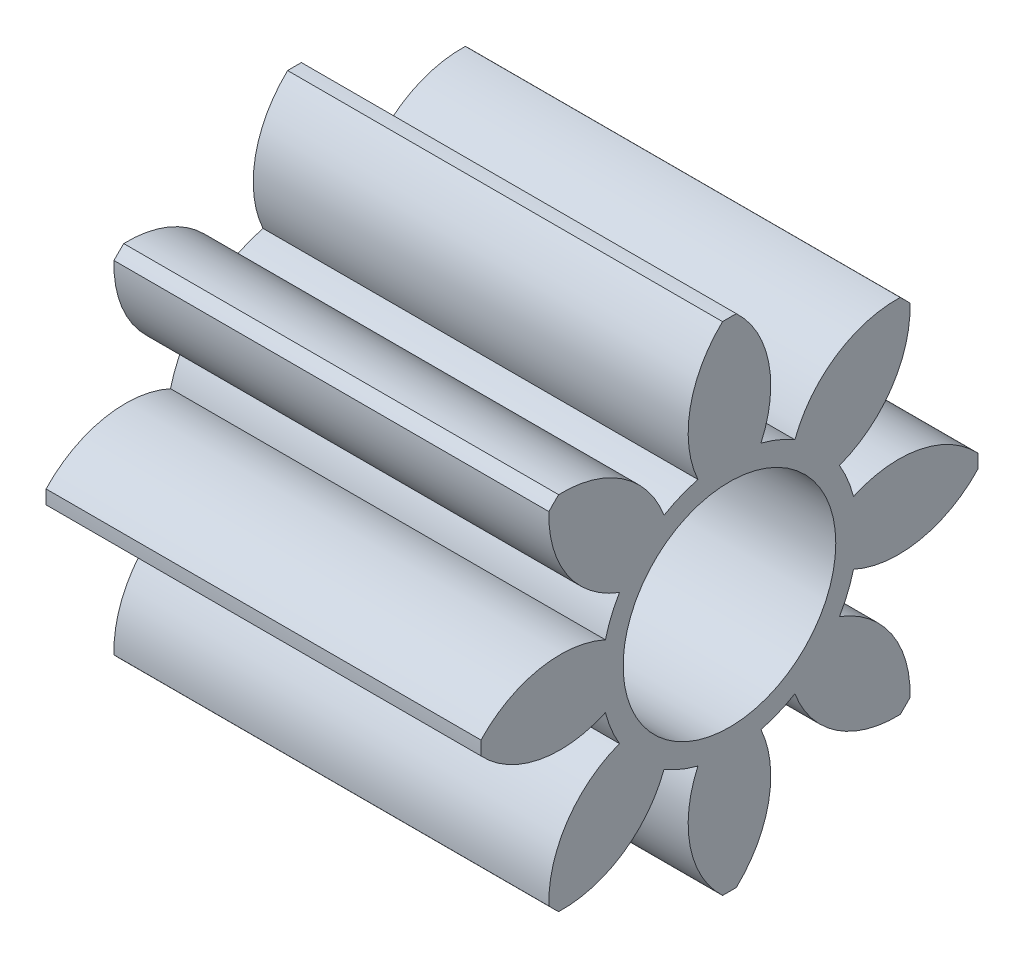
ISO-10303-21;
HEADER;
FILE_DESCRIPTION(('STEP AP214'),'2;1');
FILE_NAME('part.step','',(''),(''),'','','');
FILE_SCHEMA(('AUTOMOTIVE_DESIGN { 1 0 10303 214 1 1 1 1 }'));
ENDSEC;
DATA;
#1=APPLICATION_CONTEXT('core data for automotive mechanical design processes');
#2=APPLICATION_PROTOCOL_DEFINITION('international standard','automotive_design',2000,#1);
#3=PRODUCT_CONTEXT('',#1,'mechanical');
#4=PRODUCT('Part','Part','',(#3));
#5=PRODUCT_RELATED_PRODUCT_CATEGORY('part','',(#4));
#6=PRODUCT_DEFINITION_FORMATION('','',#4);
#7=PRODUCT_DEFINITION_CONTEXT('part definition',#1,'design');
#8=PRODUCT_DEFINITION('design','',#6,#7);
#9=PRODUCT_DEFINITION_SHAPE('','',#8);
#10=(LENGTH_UNIT() NAMED_UNIT(*) SI_UNIT(.MILLI.,.METRE.));
#11=(NAMED_UNIT(*) PLANE_ANGLE_UNIT() SI_UNIT($,.RADIAN.));
#12=(NAMED_UNIT(*) SI_UNIT($,.STERADIAN.) SOLID_ANGLE_UNIT());
#13=UNCERTAINTY_MEASURE_WITH_UNIT(LENGTH_MEASURE(1.E-05),#10,'distance_accuracy_value','');
#14=(GEOMETRIC_REPRESENTATION_CONTEXT(3) GLOBAL_UNCERTAINTY_ASSIGNED_CONTEXT((#13)) GLOBAL_UNIT_ASSIGNED_CONTEXT((#10,
#11,#12)) REPRESENTATION_CONTEXT('',''));
#15=CARTESIAN_POINT('',(0.,0.,0.));
#16=DIRECTION('',(0.,0.,1.));
#17=DIRECTION('',(1.,0.,0.));
#18=AXIS2_PLACEMENT_3D('',#15,#16,#17);
#19=CARTESIAN_POINT('',(4.,0.,0.));
#20=DIRECTION('',(-1.,0.,0.));
#21=DIRECTION('',(0.,0.,1.));
#22=AXIS2_PLACEMENT_3D('',#19,#20,#21);
#23=CYLINDRICAL_SURFACE('',#22,2.286);
#24=CARTESIAN_POINT('',(4.,0.,0.));
#25=DIRECTION('',(1.,0.,0.));
#26=DIRECTION('',(0.,0.,-1.));
#27=AXIS2_PLACEMENT_3D('',#24,#25,#26);
#28=CIRCLE('',#27,2.286);
#29=CARTESIAN_POINT('',(4.,1.66072536231653,1.57091924393287));
#30=VERTEX_POINT('',#29);
#31=CARTESIAN_POINT('',(4.,1.57091924393288,1.66072536231652));
#32=VERTEX_POINT('',#31);
#33=EDGE_CURVE('E437',#30,#32,#28,.T.);
#34=ORIENTED_EDGE('',*,*,#33,.F.);
#35=DIRECTION('',(1.,0.,0.));
#36=VECTOR('',#35,1.);
#37=CARTESIAN_POINT('',(2.,1.66072536231653,1.57091924393287));
#38=LINE('',#37,#36);
#39=CARTESIAN_POINT('',(0.,1.66072536231653,1.57091924393287));
#40=VERTEX_POINT('',#39);
#41=EDGE_CURVE('E11',#30,#40,#38,.F.);
#42=ORIENTED_EDGE('',*,*,#41,.T.);
#43=CARTESIAN_POINT('',(0.,0.,0.));
#44=DIRECTION('',(1.,0.,0.));
#45=DIRECTION('',(0.,0.,-1.));
#46=AXIS2_PLACEMENT_3D('',#43,#44,#45);
#47=CIRCLE('',#46,2.286);
#48=CARTESIAN_POINT('',(0.,1.57091924393288,1.66072536231652));
#49=VERTEX_POINT('',#48);
#50=EDGE_CURVE('E429',#40,#49,#47,.T.);
#51=ORIENTED_EDGE('',*,*,#50,.T.);
#52=DIRECTION('',(1.,0.,0.));
#53=VECTOR('',#52,1.);
#54=CARTESIAN_POINT('',(2.,1.57091924393288,1.66072536231652));
#55=LINE('',#54,#53);
#56=EDGE_CURVE('E435',#49,#32,#55,.T.);
#57=ORIENTED_EDGE('',*,*,#56,.T.);
#58=EDGE_LOOP('',(#34,#42,#51,#57));
#59=FACE_BOUND('',#58,.T.);
#60=ADVANCED_FACE('F34',(#59),#23,.T.);
#61=CARTESIAN_POINT('',(0.,2.28511781546388,-0.0635025153011266));
#62=VERTEX_POINT('',#61);
#63=CARTESIAN_POINT('',(0.,2.28511781546388,0.0635025153011124));
#64=VERTEX_POINT('',#63);
#65=EDGE_CURVE('E485',#62,#64,#47,.T.);
#66=ORIENTED_EDGE('',*,*,#65,.T.);
#67=DIRECTION('',(1.,0.,0.));
#68=VECTOR('',#67,1.);
#69=CARTESIAN_POINT('',(2.,2.28511781546388,0.0635025153011125));
#70=LINE('',#69,#68);
#71=CARTESIAN_POINT('',(4.,2.28511781546388,0.0635025153011124));
#72=VERTEX_POINT('',#71);
#73=EDGE_CURVE('E42',#64,#72,#70,.T.);
#74=ORIENTED_EDGE('',*,*,#73,.T.);
#75=CARTESIAN_POINT('',(4.,2.28511781546388,-0.0635025153011266));
#76=VERTEX_POINT('',#75);
#77=EDGE_CURVE('E483',#76,#72,#28,.T.);
#78=ORIENTED_EDGE('',*,*,#77,.F.);
#79=DIRECTION('',(1.,0.,0.));
#80=VECTOR('',#79,1.);
#81=CARTESIAN_POINT('',(2.,2.28511781546388,-0.0635025153011266));
#82=LINE('',#81,#80);
#83=EDGE_CURVE('E476',#76,#62,#82,.F.);
#84=ORIENTED_EDGE('',*,*,#83,.T.);
#85=EDGE_LOOP('',(#66,#74,#78,#84));
#86=FACE_BOUND('',#85,.T.);
#87=ADVANCED_FACE('F482',(#86),#23,.T.);
#88=CARTESIAN_POINT('',(0.,1.57091924393287,-1.66072536231653));
#89=VERTEX_POINT('',#88);
#90=CARTESIAN_POINT('',(0.,1.66072536231652,-1.57091924393288));
#91=VERTEX_POINT('',#90);
#92=EDGE_CURVE('E505',#89,#91,#47,.T.);
#93=ORIENTED_EDGE('',*,*,#92,.T.);
#94=DIRECTION('',(1.,0.,0.));
#95=VECTOR('',#94,1.);
#96=CARTESIAN_POINT('',(2.,1.66072536231652,-1.57091924393288));
#97=LINE('',#96,#95);
#98=CARTESIAN_POINT('',(4.,1.66072536231652,-1.57091924393288));
#99=VERTEX_POINT('',#98);
#100=EDGE_CURVE('E474',#91,#99,#97,.T.);
#101=ORIENTED_EDGE('',*,*,#100,.T.);
#102=CARTESIAN_POINT('',(4.,1.57091924393287,-1.66072536231653));
#103=VERTEX_POINT('',#102);
#104=EDGE_CURVE('E494',#103,#99,#28,.T.);
#105=ORIENTED_EDGE('',*,*,#104,.F.);
#106=DIRECTION('',(1.,0.,0.));
#107=VECTOR('',#106,1.);
#108=CARTESIAN_POINT('',(2.,1.57091924393287,-1.66072536231653));
#109=LINE('',#108,#107);
#110=EDGE_CURVE('E471',#103,#89,#109,.F.);
#111=ORIENTED_EDGE('',*,*,#110,.T.);
#112=EDGE_LOOP('',(#93,#101,#105,#111));
#113=FACE_BOUND('',#112,.T.);
#114=ADVANCED_FACE('F559',(#113),#23,.T.);
#115=CARTESIAN_POINT('',(0.,-0.0635025153011186,-2.28511781546388));
#116=VERTEX_POINT('',#115);
#117=CARTESIAN_POINT('',(0.,0.0635025153011045,-2.28511781546388));
#118=VERTEX_POINT('',#117);
#119=EDGE_CURVE('E507',#116,#118,#47,.T.);
#120=ORIENTED_EDGE('',*,*,#119,.T.);
#121=DIRECTION('',(1.,0.,0.));
#122=VECTOR('',#121,1.);
#123=CARTESIAN_POINT('',(2.,0.0635025153011044,-2.28511781546388));
#124=LINE('',#123,#122);
#125=CARTESIAN_POINT('',(4.,0.0635025153011048,-2.28511781546388));
#126=VERTEX_POINT('',#125);
#127=EDGE_CURVE('E468',#118,#126,#124,.T.);
#128=ORIENTED_EDGE('',*,*,#127,.T.);
#129=CARTESIAN_POINT('',(4.,-0.0635025153011186,-2.28511781546388));
#130=VERTEX_POINT('',#129);
#131=EDGE_CURVE('E496',#130,#126,#28,.T.);
#132=ORIENTED_EDGE('',*,*,#131,.F.);
#133=DIRECTION('',(1.,0.,0.));
#134=VECTOR('',#133,1.);
#135=CARTESIAN_POINT('',(2.,-0.0635025153011188,-2.28511781546388));
#136=LINE('',#135,#134);
#137=EDGE_CURVE('E465',#130,#116,#136,.F.);
#138=ORIENTED_EDGE('',*,*,#137,.T.);
#139=EDGE_LOOP('',(#120,#128,#132,#138));
#140=FACE_BOUND('',#139,.T.);
#141=ADVANCED_FACE('F549',(#140),#23,.T.);
#142=CARTESIAN_POINT('',(0.,-1.66072536231654,-1.57091924393286));
#143=VERTEX_POINT('',#142);
#144=CARTESIAN_POINT('',(0.,-1.57091924393288,-1.66072536231652));
#145=VERTEX_POINT('',#144);
#146=EDGE_CURVE('E511',#143,#145,#47,.T.);
#147=ORIENTED_EDGE('',*,*,#146,.T.);
#148=DIRECTION('',(1.,0.,0.));
#149=VECTOR('',#148,1.);
#150=CARTESIAN_POINT('',(2.,-1.57091924393288,-1.66072536231652));
#151=LINE('',#150,#149);
#152=CARTESIAN_POINT('',(4.,-1.57091924393288,-1.66072536231652));
#153=VERTEX_POINT('',#152);
#154=EDGE_CURVE('E462',#145,#153,#151,.T.);
#155=ORIENTED_EDGE('',*,*,#154,.T.);
#156=CARTESIAN_POINT('',(4.,-1.66072536231654,-1.57091924393286));
#157=VERTEX_POINT('',#156);
#158=EDGE_CURVE('E536',#157,#153,#28,.T.);
#159=ORIENTED_EDGE('',*,*,#158,.F.);
#160=DIRECTION('',(1.,0.,0.));
#161=VECTOR('',#160,1.);
#162=CARTESIAN_POINT('',(2.,-1.66072536231654,-1.57091924393286));
#163=LINE('',#162,#161);
#164=EDGE_CURVE('E459',#157,#143,#163,.F.);
#165=ORIENTED_EDGE('',*,*,#164,.T.);
#166=EDGE_LOOP('',(#147,#155,#159,#165));
#167=FACE_BOUND('',#166,.T.);
#168=ADVANCED_FACE('F602',(#167),#23,.T.);
#169=CARTESIAN_POINT('',(0.,-2.28511781546388,0.0635025153011427));
#170=VERTEX_POINT('',#169);
#171=CARTESIAN_POINT('',(0.,-2.28511781546388,-0.0635025153010967));
#172=VERTEX_POINT('',#171);
#173=EDGE_CURVE('E515',#170,#172,#47,.T.);
#174=ORIENTED_EDGE('',*,*,#173,.T.);
#175=DIRECTION('',(1.,0.,0.));
#176=VECTOR('',#175,1.);
#177=CARTESIAN_POINT('',(2.,-2.28511781546388,-0.0635025153010966));
#178=LINE('',#177,#176);
#179=CARTESIAN_POINT('',(4.,-2.28511781546388,-0.0635025153010968));
#180=VERTEX_POINT('',#179);
#181=EDGE_CURVE('E456',#172,#180,#178,.T.);
#182=ORIENTED_EDGE('',*,*,#181,.T.);
#183=CARTESIAN_POINT('',(4.,-2.28511781546388,0.0635025153011427));
#184=VERTEX_POINT('',#183);
#185=EDGE_CURVE('E534',#184,#180,#28,.T.);
#186=ORIENTED_EDGE('',*,*,#185,.F.);
#187=DIRECTION('',(1.,0.,0.));
#188=VECTOR('',#187,1.);
#189=CARTESIAN_POINT('',(2.,-2.28511781546388,0.0635025153011427));
#190=LINE('',#189,#188);
#191=EDGE_CURVE('E453',#184,#170,#190,.F.);
#192=ORIENTED_EDGE('',*,*,#191,.T.);
#193=EDGE_LOOP('',(#174,#182,#186,#192));
#194=FACE_BOUND('',#193,.T.);
#195=ADVANCED_FACE('F596',(#194),#23,.T.);
#196=CARTESIAN_POINT('',(0.,-1.57091924393286,1.66072536231654));
#197=VERTEX_POINT('',#196);
#198=CARTESIAN_POINT('',(0.,-1.6607253623165,1.57091924393289));
#199=VERTEX_POINT('',#198);
#200=EDGE_CURVE('E440',#197,#199,#47,.T.);
#201=ORIENTED_EDGE('',*,*,#200,.T.);
#202=DIRECTION('',(1.,0.,0.));
#203=VECTOR('',#202,1.);
#204=CARTESIAN_POINT('',(2.,-1.6607253623165,1.57091924393289));
#205=LINE('',#204,#203);
#206=CARTESIAN_POINT('',(4.,-1.66072536231651,1.57091924393289));
#207=VERTEX_POINT('',#206);
#208=EDGE_CURVE('E450',#199,#207,#205,.T.);
#209=ORIENTED_EDGE('',*,*,#208,.T.);
#210=CARTESIAN_POINT('',(4.,-1.57091924393286,1.66072536231654));
#211=VERTEX_POINT('',#210);
#212=EDGE_CURVE('E436',#211,#207,#28,.T.);
#213=ORIENTED_EDGE('',*,*,#212,.F.);
#214=DIRECTION('',(1.,0.,0.));
#215=VECTOR('',#214,1.);
#216=CARTESIAN_POINT('',(2.,-1.57091924393286,1.66072536231654));
#217=LINE('',#216,#215);
#218=EDGE_CURVE('E447',#211,#197,#217,.F.);
#219=ORIENTED_EDGE('',*,*,#218,.T.);
#220=EDGE_LOOP('',(#201,#209,#213,#219));
#221=FACE_BOUND('',#220,.T.);
#222=ADVANCED_FACE('F523',(#221),#23,.T.);
#223=CARTESIAN_POINT('',(4.,0.,0.));
#224=DIRECTION('',(1.,0.,0.));
#225=DIRECTION('',(0.,0.,-1.));
#226=AXIS2_PLACEMENT_3D('',#223,#224,#225);
#227=PLANE('',#226);
#228=CARTESIAN_POINT('',(4.,0.661255274895467,1.53836860107375));
#229=DIRECTION('',(-1.,0.,0.));
#230=DIRECTION('',(0.,-0.707106781186549,-0.707106781186546));
#231=AXIS2_PLACEMENT_3D('',#228,#229,#230);
#232=CIRCLE('',#231,1.);
#233=CARTESIAN_POINT('',(4.,1.01172703733527,0.601795302430052));
#234=VERTEX_POINT('',#233);
#235=EDGE_CURVE('E388',#30,#234,#232,.T.);
#236=ORIENTED_EDGE('',*,*,#235,.F.);
#237=ORIENTED_EDGE('',*,*,#33,.T.);
#238=CARTESIAN_POINT('',(4.,1.53836860107375,0.661255274895463));
#239=DIRECTION('',(-1.,0.,0.));
#240=DIRECTION('',(0.,0.,1.));
#241=AXIS2_PLACEMENT_3D('',#238,#239,#240);
#242=CIRCLE('',#241,1.);
#243=CARTESIAN_POINT('',(4.,0.601795302430055,1.01172703733527));
#244=VERTEX_POINT('',#243);
#245=EDGE_CURVE('E417',#244,#32,#242,.T.);
#246=ORIENTED_EDGE('',*,*,#245,.F.);
#247=CARTESIAN_POINT('',(4.,0.,0.));
#248=DIRECTION('',(-1.,0.,0.));
#249=DIRECTION('',(0.,0.,-1.));
#250=AXIS2_PLACEMENT_3D('',#247,#248,#249);
#251=CIRCLE('',#250,1.17717848438632);
#252=CARTESIAN_POINT('',(4.,0.289865509575043,1.14093258804404));
#253=VERTEX_POINT('',#252);
#254=EDGE_CURVE('E402',#253,#244,#251,.T.);
#255=ORIENTED_EDGE('',*,*,#254,.F.);
#256=CARTESIAN_POINT('',(4.,-0.620212780809755,1.55536895875767));
#257=DIRECTION('',(-1.,0.,0.));
#258=DIRECTION('',(0.,0.,-1.));
#259=AXIS2_PLACEMENT_3D('',#256,#257,#258);
#260=CIRCLE('',#259,1.);
#261=CARTESIAN_POINT('',(4.,0.0635025153011187,2.28511781546388));
#262=VERTEX_POINT('',#261);
#263=EDGE_CURVE('E408',#262,#253,#260,.T.);
#264=ORIENTED_EDGE('',*,*,#263,.F.);
#265=CARTESIAN_POINT('',(4.,-0.0635025153010889,2.28511781546388));
#266=VERTEX_POINT('',#265);
#267=EDGE_CURVE('E432',#262,#266,#28,.T.);
#268=ORIENTED_EDGE('',*,*,#267,.T.);
#269=CARTESIAN_POINT('',(4.,0.620212780809776,1.55536895875766));
#270=DIRECTION('',(-1.,0.,0.));
#271=DIRECTION('',(0.,-0.707106781186539,0.707106781186556));
#272=AXIS2_PLACEMENT_3D('',#269,#270,#271);
#273=CIRCLE('',#272,1.);
#274=CARTESIAN_POINT('',(4.,-0.289865509575028,1.14093258804405));
#275=VERTEX_POINT('',#274);
#276=EDGE_CURVE('E272',#275,#266,#273,.T.);
#277=ORIENTED_EDGE('',*,*,#276,.F.);
#278=CARTESIAN_POINT('',(4.,0.,0.));
#279=DIRECTION('',(-1.,0.,0.));
#280=DIRECTION('',(0.,0.707106781186539,-0.707106781186556));
#281=AXIS2_PLACEMENT_3D('',#278,#279,#280);
#282=CIRCLE('',#281,1.17717848438632);
#283=CARTESIAN_POINT('',(4.,-0.601795302430041,1.01172703733528));
#284=VERTEX_POINT('',#283);
#285=EDGE_CURVE('E251',#284,#275,#282,.T.);
#286=ORIENTED_EDGE('',*,*,#285,.F.);
#287=CARTESIAN_POINT('',(4.,-1.53836860107374,0.661255274895483));
#288=DIRECTION('',(-1.,0.,0.));
#289=DIRECTION('',(0.,0.707106781186539,-0.707106781186556));
#290=AXIS2_PLACEMENT_3D('',#287,#288,#289);
#291=CIRCLE('',#290,1.);
#292=EDGE_CURVE('E270',#211,#284,#291,.T.);
#293=ORIENTED_EDGE('',*,*,#292,.F.);
#294=ORIENTED_EDGE('',*,*,#212,.T.);
#295=CARTESIAN_POINT('',(4.,-0.661255274895447,1.53836860107376));
#296=DIRECTION('',(-1.,0.,0.));
#297=DIRECTION('',(0.,-1.,0.));
#298=AXIS2_PLACEMENT_3D('',#295,#296,#297);
#299=CIRCLE('',#298,1.);
#300=CARTESIAN_POINT('',(4.,-1.01172703733526,0.601795302430066));
#301=VERTEX_POINT('',#300);
#302=EDGE_CURVE('E293',#301,#207,#299,.T.);
#303=ORIENTED_EDGE('',*,*,#302,.F.);
#304=CARTESIAN_POINT('',(4.,0.,0.));
#305=DIRECTION('',(-1.,0.,0.));
#306=DIRECTION('',(0.,1.,0.));
#307=AXIS2_PLACEMENT_3D('',#304,#305,#306);
#308=CIRCLE('',#307,1.17717848438632);
#309=CARTESIAN_POINT('',(4.,-1.14093258804404,0.289865509575055));
#310=VERTEX_POINT('',#309);
#311=EDGE_CURVE('E278',#310,#301,#308,.T.);
#312=ORIENTED_EDGE('',*,*,#311,.F.);
#313=CARTESIAN_POINT('',(4.,-1.55536895875768,-0.620212780809739));
#314=DIRECTION('',(-1.,0.,0.));
#315=DIRECTION('',(0.,1.,0.));
#316=AXIS2_PLACEMENT_3D('',#313,#314,#315);
#317=CIRCLE('',#316,1.);
#318=EDGE_CURVE('E284',#184,#310,#317,.T.);
#319=ORIENTED_EDGE('',*,*,#318,.F.);
#320=ORIENTED_EDGE('',*,*,#185,.T.);
#321=CARTESIAN_POINT('',(4.,-1.55536895875766,0.62021278080977));
#322=DIRECTION('',(-1.,0.,0.));
#323=DIRECTION('',(0.,-0.707106781186554,-0.707106781186541));
#324=AXIS2_PLACEMENT_3D('',#321,#322,#323);
#325=CIRCLE('',#324,1.);
#326=CARTESIAN_POINT('',(4.,-1.14093258804405,-0.289865509575032));
#327=VERTEX_POINT('',#326);
#328=EDGE_CURVE('E314',#327,#180,#325,.T.);
#329=ORIENTED_EDGE('',*,*,#328,.F.);
#330=CARTESIAN_POINT('',(4.,0.,0.));
#331=DIRECTION('',(-1.,0.,0.));
#332=DIRECTION('',(0.,0.707106781186554,0.707106781186541));
#333=AXIS2_PLACEMENT_3D('',#330,#331,#332);
#334=CIRCLE('',#333,1.17717848438632);
#335=CARTESIAN_POINT('',(4.,-1.01172703733527,-0.601795302430045));
#336=VERTEX_POINT('',#335);
#337=EDGE_CURVE('E299',#336,#327,#334,.T.);
#338=ORIENTED_EDGE('',*,*,#337,.F.);
#339=CARTESIAN_POINT('',(4.,-0.661255274895478,-1.53836860107375));
#340=DIRECTION('',(-1.,0.,0.));
#341=DIRECTION('',(0.,0.707106781186554,0.707106781186541));
#342=AXIS2_PLACEMENT_3D('',#339,#340,#341);
#343=CIRCLE('',#342,1.);
#344=EDGE_CURVE('E305',#157,#336,#343,.T.);
#345=ORIENTED_EDGE('',*,*,#344,.F.);
#346=ORIENTED_EDGE('',*,*,#158,.T.);
#347=CARTESIAN_POINT('',(4.,-1.53836860107375,-0.661255274895463));
#348=DIRECTION('',(-1.,0.,0.));
#349=DIRECTION('',(0.,0.,-1.));
#350=AXIS2_PLACEMENT_3D('',#347,#348,#349);
#351=CIRCLE('',#350,1.);
#352=CARTESIAN_POINT('',(4.,-0.601795302430055,-1.01172703733527));
#353=VERTEX_POINT('',#352);
#354=EDGE_CURVE('E335',#353,#153,#351,.T.);
#355=ORIENTED_EDGE('',*,*,#354,.F.);
#356=CARTESIAN_POINT('',(4.,0.,0.));
#357=DIRECTION('',(-1.,0.,0.));
#358=DIRECTION('',(0.,0.,1.));
#359=AXIS2_PLACEMENT_3D('',#356,#357,#358);
#360=CIRCLE('',#359,1.17717848438632);
#361=CARTESIAN_POINT('',(4.,-0.289865509575043,-1.14093258804404));
#362=VERTEX_POINT('',#361);
#363=EDGE_CURVE('E320',#362,#353,#360,.T.);
#364=ORIENTED_EDGE('',*,*,#363,.F.);
#365=CARTESIAN_POINT('',(4.,0.620212780809755,-1.55536895875767));
#366=DIRECTION('',(-1.,0.,0.));
#367=DIRECTION('',(0.,0.,1.));
#368=AXIS2_PLACEMENT_3D('',#365,#366,#367);
#369=CIRCLE('',#368,1.);
#370=EDGE_CURVE('E326',#130,#362,#369,.T.);
#371=ORIENTED_EDGE('',*,*,#370,.F.);
#372=ORIENTED_EDGE('',*,*,#131,.T.);
#373=CARTESIAN_POINT('',(4.,-0.620212780809765,-1.55536895875767));
#374=DIRECTION('',(-1.,0.,0.));
#375=DIRECTION('',(0.,0.707106781186544,-0.707106781186551));
#376=AXIS2_PLACEMENT_3D('',#373,#374,#375);
#377=CIRCLE('',#376,1.);
#378=CARTESIAN_POINT('',(4.,0.289865509575036,-1.14093258804405));
#379=VERTEX_POINT('',#378);
#380=EDGE_CURVE('E356',#379,#126,#377,.T.);
#381=ORIENTED_EDGE('',*,*,#380,.F.);
#382=CARTESIAN_POINT('',(4.,0.,0.));
#383=DIRECTION('',(-1.,0.,0.));
#384=DIRECTION('',(0.,-0.707106781186544,0.707106781186551));
#385=AXIS2_PLACEMENT_3D('',#382,#383,#384);
#386=CIRCLE('',#385,1.17717848438632);
#387=CARTESIAN_POINT('',(4.,0.601795302430048,-1.01172703733527));
#388=VERTEX_POINT('',#387);
#389=EDGE_CURVE('E341',#388,#379,#386,.T.);
#390=ORIENTED_EDGE('',*,*,#389,.F.);
#391=CARTESIAN_POINT('',(4.,1.53836860107375,-0.661255274895472));
#392=DIRECTION('',(-1.,0.,0.));
#393=DIRECTION('',(0.,-0.707106781186544,0.707106781186551));
#394=AXIS2_PLACEMENT_3D('',#391,#392,#393);
#395=CIRCLE('',#394,1.);
#396=EDGE_CURVE('E347',#103,#388,#395,.T.);
#397=ORIENTED_EDGE('',*,*,#396,.F.);
#398=ORIENTED_EDGE('',*,*,#104,.T.);
#399=CARTESIAN_POINT('',(4.,0.661255274895458,-1.53836860107376));
#400=DIRECTION('',(-1.,0.,0.));
#401=DIRECTION('',(0.,1.,0.));
#402=AXIS2_PLACEMENT_3D('',#399,#400,#401);
#403=CIRCLE('',#402,1.);
#404=CARTESIAN_POINT('',(4.,1.01172703733527,-0.601795302430059));
#405=VERTEX_POINT('',#404);
#406=EDGE_CURVE('E57',#405,#99,#403,.T.);
#407=ORIENTED_EDGE('',*,*,#406,.F.);
#408=CARTESIAN_POINT('',(4.,0.,0.));
#409=DIRECTION('',(-1.,0.,0.));
#410=DIRECTION('',(0.,-1.,0.));
#411=AXIS2_PLACEMENT_3D('',#408,#409,#410);
#412=CIRCLE('',#411,1.17717848438632);
#413=CARTESIAN_POINT('',(4.,1.14093258804404,-0.289865509575047));
#414=VERTEX_POINT('',#413);
#415=EDGE_CURVE('E362',#414,#405,#412,.T.);
#416=ORIENTED_EDGE('',*,*,#415,.F.);
#417=CARTESIAN_POINT('',(4.,1.55536895875767,0.62021278080975));
#418=DIRECTION('',(-1.,0.,0.));
#419=DIRECTION('',(0.,-1.,0.));
#420=AXIS2_PLACEMENT_3D('',#417,#418,#419);
#421=CIRCLE('',#420,1.);
#422=EDGE_CURVE('E368',#76,#414,#421,.T.);
#423=ORIENTED_EDGE('',*,*,#422,.F.);
#424=ORIENTED_EDGE('',*,*,#77,.T.);
#425=CARTESIAN_POINT('',(4.,1.55536895875767,-0.62021278080976));
#426=DIRECTION('',(-1.,0.,0.));
#427=DIRECTION('',(0.,0.707106781186549,0.707106781186546));
#428=AXIS2_PLACEMENT_3D('',#425,#426,#427);
#429=CIRCLE('',#428,1.);
#430=CARTESIAN_POINT('',(4.,1.14093258804404,0.28986550957504));
#431=VERTEX_POINT('',#430);
#432=EDGE_CURVE('E49',#431,#72,#429,.T.);
#433=ORIENTED_EDGE('',*,*,#432,.F.);
#434=CARTESIAN_POINT('',(4.,0.,0.));
#435=DIRECTION('',(-1.,0.,0.));
#436=DIRECTION('',(0.,-0.707106781186549,-0.707106781186546));
#437=AXIS2_PLACEMENT_3D('',#434,#435,#436);
#438=CIRCLE('',#437,1.17717848438632);
#439=EDGE_CURVE('E382',#234,#431,#438,.T.);
#440=ORIENTED_EDGE('',*,*,#439,.F.);
#441=EDGE_LOOP('',(#236,#237,#246,#255,#264,#268,#277,#286,#293,#294,#303,#312,#319,#320,#329,
#338,#345,#346,#355,#364,#371,#372,#381,#390,#397,#398,#407,#416,#423,#424,#433,#440));
#442=FACE_BOUND('',#441,.T.);
#443=CARTESIAN_POINT('',(4.,0.,0.));
#444=DIRECTION('',(1.,0.,0.));
#445=DIRECTION('',(0.,0.,-1.));
#446=AXIS2_PLACEMENT_3D('',#443,#444,#445);
#447=CIRCLE('',#446,0.9779);
#448=CARTESIAN_POINT('',(4.,0.,-0.9779));
#449=VERTEX_POINT('',#448);
#450=EDGE_CURVE('E426',#449,#449,#447,.T.);
#451=ORIENTED_EDGE('',*,*,#450,.F.);
#452=EDGE_LOOP('',(#451));
#453=FACE_BOUND('',#452,.T.);
#454=ADVANCED_FACE('F490',(#442,#453),#227,.T.);
#455=CARTESIAN_POINT('',(0.,0.,0.));
#456=DIRECTION('',(1.,0.,0.));
#457=DIRECTION('',(0.,0.,-1.));
#458=AXIS2_PLACEMENT_3D('',#455,#456,#457);
#459=PLANE('',#458);
#460=ORIENTED_EDGE('',*,*,#50,.F.);
#461=CARTESIAN_POINT('',(0.,0.661255274895467,1.53836860107375));
#462=DIRECTION('',(-1.,0.,0.));
#463=DIRECTION('',(0.,-0.707106781186549,-0.707106781186546));
#464=AXIS2_PLACEMENT_3D('',#461,#462,#463);
#465=CIRCLE('',#464,1.);
#466=CARTESIAN_POINT('',(0.,1.01172703733527,0.601795302430052));
#467=VERTEX_POINT('',#466);
#468=EDGE_CURVE('E391',#40,#467,#465,.T.);
#469=ORIENTED_EDGE('',*,*,#468,.T.);
#470=CARTESIAN_POINT('',(0.,0.,0.));
#471=DIRECTION('',(-1.,0.,0.));
#472=DIRECTION('',(0.,-0.707106781186549,-0.707106781186546));
#473=AXIS2_PLACEMENT_3D('',#470,#471,#472);
#474=CIRCLE('',#473,1.17717848438632);
#475=CARTESIAN_POINT('',(0.,1.14093258804404,0.28986550957504));
#476=VERTEX_POINT('',#475);
#477=EDGE_CURVE('E384',#467,#476,#474,.T.);
#478=ORIENTED_EDGE('',*,*,#477,.T.);
#479=CARTESIAN_POINT('',(0.,1.55536895875767,-0.62021278080976));
#480=DIRECTION('',(-1.,0.,0.));
#481=DIRECTION('',(0.,0.707106781186549,0.707106781186546));
#482=AXIS2_PLACEMENT_3D('',#479,#480,#481);
#483=CIRCLE('',#482,1.);
#484=EDGE_CURVE('E387',#476,#64,#483,.T.);
#485=ORIENTED_EDGE('',*,*,#484,.T.);
#486=ORIENTED_EDGE('',*,*,#65,.F.);
#487=CARTESIAN_POINT('',(0.,1.55536895875767,0.62021278080975));
#488=DIRECTION('',(-1.,0.,0.));
#489=DIRECTION('',(0.,-1.,0.));
#490=AXIS2_PLACEMENT_3D('',#487,#488,#489);
#491=CIRCLE('',#490,1.);
#492=CARTESIAN_POINT('',(0.,1.14093258804404,-0.289865509575047));
#493=VERTEX_POINT('',#492);
#494=EDGE_CURVE('E371',#62,#493,#491,.T.);
#495=ORIENTED_EDGE('',*,*,#494,.T.);
#496=CARTESIAN_POINT('',(0.,0.,0.));
#497=DIRECTION('',(-1.,0.,0.));
#498=DIRECTION('',(0.,-1.,0.));
#499=AXIS2_PLACEMENT_3D('',#496,#497,#498);
#500=CIRCLE('',#499,1.17717848438632);
#501=CARTESIAN_POINT('',(0.,1.01172703733527,-0.601795302430059));
#502=VERTEX_POINT('',#501);
#503=EDGE_CURVE('E364',#493,#502,#500,.T.);
#504=ORIENTED_EDGE('',*,*,#503,.T.);
#505=CARTESIAN_POINT('',(0.,0.661255274895458,-1.53836860107376));
#506=DIRECTION('',(-1.,0.,0.));
#507=DIRECTION('',(0.,1.,0.));
#508=AXIS2_PLACEMENT_3D('',#505,#506,#507);
#509=CIRCLE('',#508,1.);
#510=EDGE_CURVE('E367',#502,#91,#509,.T.);
#511=ORIENTED_EDGE('',*,*,#510,.T.);
#512=ORIENTED_EDGE('',*,*,#92,.F.);
#513=CARTESIAN_POINT('',(0.,1.53836860107375,-0.661255274895472));
#514=DIRECTION('',(-1.,0.,0.));
#515=DIRECTION('',(0.,-0.707106781186544,0.707106781186551));
#516=AXIS2_PLACEMENT_3D('',#513,#514,#515);
#517=CIRCLE('',#516,1.);
#518=CARTESIAN_POINT('',(0.,0.601795302430048,-1.01172703733527));
#519=VERTEX_POINT('',#518);
#520=EDGE_CURVE('E350',#89,#519,#517,.T.);
#521=ORIENTED_EDGE('',*,*,#520,.T.);
#522=CARTESIAN_POINT('',(0.,0.,0.));
#523=DIRECTION('',(-1.,0.,0.));
#524=DIRECTION('',(0.,-0.707106781186544,0.707106781186551));
#525=AXIS2_PLACEMENT_3D('',#522,#523,#524);
#526=CIRCLE('',#525,1.17717848438632);
#527=CARTESIAN_POINT('',(0.,0.289865509575036,-1.14093258804405));
#528=VERTEX_POINT('',#527);
#529=EDGE_CURVE('E343',#519,#528,#526,.T.);
#530=ORIENTED_EDGE('',*,*,#529,.T.);
#531=CARTESIAN_POINT('',(0.,-0.620212780809765,-1.55536895875767));
#532=DIRECTION('',(-1.,0.,0.));
#533=DIRECTION('',(0.,0.707106781186544,-0.707106781186551));
#534=AXIS2_PLACEMENT_3D('',#531,#532,#533);
#535=CIRCLE('',#534,1.);
#536=EDGE_CURVE('E346',#528,#118,#535,.T.);
#537=ORIENTED_EDGE('',*,*,#536,.T.);
#538=ORIENTED_EDGE('',*,*,#119,.F.);
#539=CARTESIAN_POINT('',(0.,0.620212780809755,-1.55536895875767));
#540=DIRECTION('',(-1.,0.,0.));
#541=DIRECTION('',(0.,0.,1.));
#542=AXIS2_PLACEMENT_3D('',#539,#540,#541);
#543=CIRCLE('',#542,1.);
#544=CARTESIAN_POINT('',(0.,-0.289865509575043,-1.14093258804404));
#545=VERTEX_POINT('',#544);
#546=EDGE_CURVE('E329',#116,#545,#543,.T.);
#547=ORIENTED_EDGE('',*,*,#546,.T.);
#548=CARTESIAN_POINT('',(0.,0.,0.));
#549=DIRECTION('',(-1.,0.,0.));
#550=DIRECTION('',(0.,0.,1.));
#551=AXIS2_PLACEMENT_3D('',#548,#549,#550);
#552=CIRCLE('',#551,1.17717848438632);
#553=CARTESIAN_POINT('',(0.,-0.601795302430055,-1.01172703733527));
#554=VERTEX_POINT('',#553);
#555=EDGE_CURVE('E322',#545,#554,#552,.T.);
#556=ORIENTED_EDGE('',*,*,#555,.T.);
#557=CARTESIAN_POINT('',(0.,-1.53836860107375,-0.661255274895463));
#558=DIRECTION('',(-1.,0.,0.));
#559=DIRECTION('',(0.,0.,-1.));
#560=AXIS2_PLACEMENT_3D('',#557,#558,#559);
#561=CIRCLE('',#560,1.);
#562=EDGE_CURVE('E325',#554,#145,#561,.T.);
#563=ORIENTED_EDGE('',*,*,#562,.T.);
#564=ORIENTED_EDGE('',*,*,#146,.F.);
#565=CARTESIAN_POINT('',(0.,-0.661255274895478,-1.53836860107375));
#566=DIRECTION('',(-1.,0.,0.));
#567=DIRECTION('',(0.,0.707106781186554,0.707106781186541));
#568=AXIS2_PLACEMENT_3D('',#565,#566,#567);
#569=CIRCLE('',#568,1.);
#570=CARTESIAN_POINT('',(0.,-1.01172703733527,-0.601795302430045));
#571=VERTEX_POINT('',#570);
#572=EDGE_CURVE('E308',#143,#571,#569,.T.);
#573=ORIENTED_EDGE('',*,*,#572,.T.);
#574=CARTESIAN_POINT('',(0.,0.,0.));
#575=DIRECTION('',(-1.,0.,0.));
#576=DIRECTION('',(0.,0.707106781186554,0.707106781186541));
#577=AXIS2_PLACEMENT_3D('',#574,#575,#576);
#578=CIRCLE('',#577,1.17717848438632);
#579=CARTESIAN_POINT('',(0.,-1.14093258804405,-0.289865509575032));
#580=VERTEX_POINT('',#579);
#581=EDGE_CURVE('E301',#571,#580,#578,.T.);
#582=ORIENTED_EDGE('',*,*,#581,.T.);
#583=CARTESIAN_POINT('',(0.,-1.55536895875766,0.62021278080977));
#584=DIRECTION('',(-1.,0.,0.));
#585=DIRECTION('',(0.,-0.707106781186554,-0.707106781186541));
#586=AXIS2_PLACEMENT_3D('',#583,#584,#585);
#587=CIRCLE('',#586,1.);
#588=EDGE_CURVE('E304',#580,#172,#587,.T.);
#589=ORIENTED_EDGE('',*,*,#588,.T.);
#590=ORIENTED_EDGE('',*,*,#173,.F.);
#591=CARTESIAN_POINT('',(0.,-1.55536895875768,-0.620212780809739));
#592=DIRECTION('',(-1.,0.,0.));
#593=DIRECTION('',(0.,1.,0.));
#594=AXIS2_PLACEMENT_3D('',#591,#592,#593);
#595=CIRCLE('',#594,1.);
#596=CARTESIAN_POINT('',(0.,-1.14093258804404,0.289865509575055));
#597=VERTEX_POINT('',#596);
#598=EDGE_CURVE('E287',#170,#597,#595,.T.);
#599=ORIENTED_EDGE('',*,*,#598,.T.);
#600=CARTESIAN_POINT('',(0.,0.,0.));
#601=DIRECTION('',(-1.,0.,0.));
#602=DIRECTION('',(0.,1.,0.));
#603=AXIS2_PLACEMENT_3D('',#600,#601,#602);
#604=CIRCLE('',#603,1.17717848438632);
#605=CARTESIAN_POINT('',(0.,-1.01172703733526,0.601795302430066));
#606=VERTEX_POINT('',#605);
#607=EDGE_CURVE('E280',#597,#606,#604,.T.);
#608=ORIENTED_EDGE('',*,*,#607,.T.);
#609=CARTESIAN_POINT('',(0.,-0.661255274895447,1.53836860107376));
#610=DIRECTION('',(-1.,0.,0.));
#611=DIRECTION('',(0.,-1.,0.));
#612=AXIS2_PLACEMENT_3D('',#609,#610,#611);
#613=CIRCLE('',#612,1.);
#614=EDGE_CURVE('E283',#606,#199,#613,.T.);
#615=ORIENTED_EDGE('',*,*,#614,.T.);
#616=ORIENTED_EDGE('',*,*,#200,.F.);
#617=CARTESIAN_POINT('',(0.,-1.53836860107374,0.661255274895483));
#618=DIRECTION('',(-1.,0.,0.));
#619=DIRECTION('',(0.,0.707106781186539,-0.707106781186556));
#620=AXIS2_PLACEMENT_3D('',#617,#618,#619);
#621=CIRCLE('',#620,1.);
#622=CARTESIAN_POINT('',(0.,-0.601795302430041,1.01172703733528));
#623=VERTEX_POINT('',#622);
#624=EDGE_CURVE('E255',#197,#623,#621,.T.);
#625=ORIENTED_EDGE('',*,*,#624,.T.);
#626=CARTESIAN_POINT('',(0.,0.,0.));
#627=DIRECTION('',(-1.,0.,0.));
#628=DIRECTION('',(0.,0.707106781186539,-0.707106781186556));
#629=AXIS2_PLACEMENT_3D('',#626,#627,#628);
#630=CIRCLE('',#629,1.17717848438632);
#631=CARTESIAN_POINT('',(0.,-0.289865509575028,1.14093258804405));
#632=VERTEX_POINT('',#631);
#633=EDGE_CURVE('E248',#623,#632,#630,.T.);
#634=ORIENTED_EDGE('',*,*,#633,.T.);
#635=CARTESIAN_POINT('',(0.,0.620212780809776,1.55536895875766));
#636=DIRECTION('',(-1.,0.,0.));
#637=DIRECTION('',(0.,-0.707106781186539,0.707106781186556));
#638=AXIS2_PLACEMENT_3D('',#635,#636,#637);
#639=CIRCLE('',#638,1.);
#640=CARTESIAN_POINT('',(0.,-0.0635025153010888,2.28511781546388));
#641=VERTEX_POINT('',#640);
#642=EDGE_CURVE('E258',#632,#641,#639,.T.);
#643=ORIENTED_EDGE('',*,*,#642,.T.);
#644=CARTESIAN_POINT('',(0.,0.0635025153011187,2.28511781546388));
#645=VERTEX_POINT('',#644);
#646=EDGE_CURVE('E438',#645,#641,#47,.T.);
#647=ORIENTED_EDGE('',*,*,#646,.F.);
#648=CARTESIAN_POINT('',(0.,-0.620212780809755,1.55536895875767));
#649=DIRECTION('',(-1.,0.,0.));
#650=DIRECTION('',(0.,0.,-1.));
#651=AXIS2_PLACEMENT_3D('',#648,#649,#650);
#652=CIRCLE('',#651,1.);
#653=CARTESIAN_POINT('',(0.,0.289865509575043,1.14093258804404));
#654=VERTEX_POINT('',#653);
#655=EDGE_CURVE('E411',#645,#654,#652,.T.);
#656=ORIENTED_EDGE('',*,*,#655,.T.);
#657=CARTESIAN_POINT('',(0.,0.,0.));
#658=DIRECTION('',(-1.,0.,0.));
#659=DIRECTION('',(0.,0.,-1.));
#660=AXIS2_PLACEMENT_3D('',#657,#658,#659);
#661=CIRCLE('',#660,1.17717848438632);
#662=CARTESIAN_POINT('',(0.,0.601795302430055,1.01172703733527));
#663=VERTEX_POINT('',#662);
#664=EDGE_CURVE('E404',#654,#663,#661,.T.);
#665=ORIENTED_EDGE('',*,*,#664,.T.);
#666=CARTESIAN_POINT('',(0.,1.53836860107375,0.661255274895463));
#667=DIRECTION('',(-1.,0.,0.));
#668=DIRECTION('',(0.,0.,1.));
#669=AXIS2_PLACEMENT_3D('',#666,#667,#668);
#670=CIRCLE('',#669,1.);
#671=EDGE_CURVE('E407',#663,#49,#670,.T.);
#672=ORIENTED_EDGE('',*,*,#671,.T.);
#673=EDGE_LOOP('',(#460,#469,#478,#485,#486,#495,#504,#511,#512,#521,#530,#537,#538,#547,#556,
#563,#564,#573,#582,#589,#590,#599,#608,#615,#616,#625,#634,#643,#647,#656,#665,#672));
#674=FACE_BOUND('',#673,.T.);
#675=CARTESIAN_POINT('',(0.,0.,0.));
#676=DIRECTION('',(1.,0.,0.));
#677=DIRECTION('',(0.,0.,-1.));
#678=AXIS2_PLACEMENT_3D('',#675,#676,#677);
#679=CIRCLE('',#678,0.9779);
#680=CARTESIAN_POINT('',(0.,0.,-0.9779));
#681=VERTEX_POINT('',#680);
#682=EDGE_CURVE('E424',#681,#681,#679,.T.);
#683=ORIENTED_EDGE('',*,*,#682,.T.);
#684=EDGE_LOOP('',(#683));
#685=FACE_BOUND('',#684,.T.);
#686=ADVANCED_FACE('F267',(#674,#685),#459,.F.);
#687=ORIENTED_EDGE('',*,*,#646,.T.);
#688=DIRECTION('',(1.,0.,0.));
#689=VECTOR('',#688,1.);
#690=CARTESIAN_POINT('',(2.,-0.0635025153010887,2.28511781546388));
#691=LINE('',#690,#689);
#692=EDGE_CURVE('E261',#641,#266,#691,.T.);
#693=ORIENTED_EDGE('',*,*,#692,.T.);
#694=ORIENTED_EDGE('',*,*,#267,.F.);
#695=DIRECTION('',(1.,0.,0.));
#696=VECTOR('',#695,1.);
#697=CARTESIAN_POINT('',(2.,0.0635025153011188,2.28511781546388));
#698=LINE('',#697,#696);
#699=EDGE_CURVE('E443',#262,#645,#698,.F.);
#700=ORIENTED_EDGE('',*,*,#699,.T.);
#701=EDGE_LOOP('',(#687,#693,#694,#700));
#702=FACE_BOUND('',#701,.T.);
#703=ADVANCED_FACE('F36',(#702),#23,.T.);
#704=CARTESIAN_POINT('',(4.,0.,0.));
#705=DIRECTION('',(-1.,0.,0.));
#706=DIRECTION('',(0.,0.,1.));
#707=AXIS2_PLACEMENT_3D('',#704,#705,#706);
#708=CYLINDRICAL_SURFACE('',#707,0.9779);
#709=ORIENTED_EDGE('',*,*,#450,.T.);
#710=EDGE_LOOP('',(#709));
#711=FACE_BOUND('',#710,.T.);
#712=ORIENTED_EDGE('',*,*,#682,.F.);
#713=EDGE_LOOP('',(#712));
#714=FACE_BOUND('',#713,.T.);
#715=ADVANCED_FACE('F586',(#711,#714),#708,.F.);
#716=CARTESIAN_POINT('',(0.,-0.620212780809755,1.55536895875767));
#717=DIRECTION('',(1.,0.,0.));
#718=DIRECTION('',(0.,0.,-1.));
#719=AXIS2_PLACEMENT_3D('',#716,#717,#718);
#720=CYLINDRICAL_SURFACE('',#719,1.);
#721=ORIENTED_EDGE('',*,*,#263,.T.);
#722=DIRECTION('',(1.,0.,0.));
#723=VECTOR('',#722,1.);
#724=CARTESIAN_POINT('',(0.,0.289865509575043,1.14093258804404));
#725=LINE('',#724,#723);
#726=EDGE_CURVE('E421',#654,#253,#725,.T.);
#727=ORIENTED_EDGE('',*,*,#726,.F.);
#728=ORIENTED_EDGE('',*,*,#655,.F.);
#729=ORIENTED_EDGE('',*,*,#699,.F.);
#730=EDGE_LOOP('',(#721,#727,#728,#729));
#731=FACE_BOUND('',#730,.T.);
#732=ADVANCED_FACE('F592',(#731),#720,.T.);
#733=CARTESIAN_POINT('',(0.,1.53836860107375,0.661255274895463));
#734=DIRECTION('',(1.,0.,0.));
#735=DIRECTION('',(0.,0.,-1.));
#736=AXIS2_PLACEMENT_3D('',#733,#734,#735);
#737=CYLINDRICAL_SURFACE('',#736,1.);
#738=ORIENTED_EDGE('',*,*,#671,.F.);
#739=DIRECTION('',(1.,0.,0.));
#740=VECTOR('',#739,1.);
#741=CARTESIAN_POINT('',(0.,0.601795302430055,1.01172703733527));
#742=LINE('',#741,#740);
#743=EDGE_CURVE('E414',#663,#244,#742,.T.);
#744=ORIENTED_EDGE('',*,*,#743,.T.);
#745=ORIENTED_EDGE('',*,*,#245,.T.);
#746=ORIENTED_EDGE('',*,*,#56,.F.);
#747=EDGE_LOOP('',(#738,#744,#745,#746));
#748=FACE_BOUND('',#747,.T.);
#749=ADVANCED_FACE('F504',(#748),#737,.T.);
#750=CARTESIAN_POINT('',(0.,0.,0.));
#751=DIRECTION('',(1.,0.,0.));
#752=DIRECTION('',(0.,0.,-1.));
#753=AXIS2_PLACEMENT_3D('',#750,#751,#752);
#754=CYLINDRICAL_SURFACE('',#753,1.17717848438632);
#755=ORIENTED_EDGE('',*,*,#254,.T.);
#756=ORIENTED_EDGE('',*,*,#743,.F.);
#757=ORIENTED_EDGE('',*,*,#664,.F.);
#758=ORIENTED_EDGE('',*,*,#726,.T.);
#759=EDGE_LOOP('',(#755,#756,#757,#758));
#760=FACE_BOUND('',#759,.T.);
#761=ADVANCED_FACE('F628',(#760),#754,.T.);
#762=CARTESIAN_POINT('',(0.,0.620212780809776,1.55536895875766));
#763=DIRECTION('',(1.,0.,0.));
#764=DIRECTION('',(0.,0.,-1.));
#765=AXIS2_PLACEMENT_3D('',#762,#763,#764);
#766=CYLINDRICAL_SURFACE('',#765,1.);
#767=ORIENTED_EDGE('',*,*,#642,.F.);
#768=DIRECTION('',(1.,0.,0.));
#769=VECTOR('',#768,1.);
#770=CARTESIAN_POINT('',(0.,-0.289865509575028,1.14093258804405));
#771=LINE('',#770,#769);
#772=EDGE_CURVE('E243',#632,#275,#771,.T.);
#773=ORIENTED_EDGE('',*,*,#772,.T.);
#774=ORIENTED_EDGE('',*,*,#276,.T.);
#775=ORIENTED_EDGE('',*,*,#692,.F.);
#776=EDGE_LOOP('',(#767,#773,#774,#775));
#777=FACE_BOUND('',#776,.T.);
#778=ADVANCED_FACE('F259',(#777),#766,.T.);
#779=CARTESIAN_POINT('',(0.,-1.53836860107374,0.661255274895483));
#780=DIRECTION('',(1.,0.,0.));
#781=DIRECTION('',(0.,0.,-1.));
#782=AXIS2_PLACEMENT_3D('',#779,#780,#781);
#783=CYLINDRICAL_SURFACE('',#782,1.);
#784=ORIENTED_EDGE('',*,*,#292,.T.);
#785=DIRECTION('',(1.,0.,0.));
#786=VECTOR('',#785,1.);
#787=CARTESIAN_POINT('',(0.,-0.601795302430041,1.01172703733528));
#788=LINE('',#787,#786);
#789=EDGE_CURVE('E254',#623,#284,#788,.T.);
#790=ORIENTED_EDGE('',*,*,#789,.F.);
#791=ORIENTED_EDGE('',*,*,#624,.F.);
#792=ORIENTED_EDGE('',*,*,#218,.F.);
#793=EDGE_LOOP('',(#784,#790,#791,#792));
#794=FACE_BOUND('',#793,.T.);
#795=ADVANCED_FACE('F698',(#794),#783,.T.);
#796=CARTESIAN_POINT('',(0.,0.,0.));
#797=DIRECTION('',(1.,0.,0.));
#798=DIRECTION('',(0.,0.,-1.));
#799=AXIS2_PLACEMENT_3D('',#796,#797,#798);
#800=CYLINDRICAL_SURFACE('',#799,1.17717848438632);
#801=ORIENTED_EDGE('',*,*,#285,.T.);
#802=ORIENTED_EDGE('',*,*,#772,.F.);
#803=ORIENTED_EDGE('',*,*,#633,.F.);
#804=ORIENTED_EDGE('',*,*,#789,.T.);
#805=EDGE_LOOP('',(#801,#802,#803,#804));
#806=FACE_BOUND('',#805,.T.);
#807=ADVANCED_FACE('F245',(#806),#800,.T.);
#808=CARTESIAN_POINT('',(0.,-0.661255274895447,1.53836860107376));
#809=DIRECTION('',(1.,0.,0.));
#810=DIRECTION('',(0.,0.,-1.));
#811=AXIS2_PLACEMENT_3D('',#808,#809,#810);
#812=CYLINDRICAL_SURFACE('',#811,1.);
#813=ORIENTED_EDGE('',*,*,#614,.F.);
#814=DIRECTION('',(1.,0.,0.));
#815=VECTOR('',#814,1.);
#816=CARTESIAN_POINT('',(0.,-1.01172703733526,0.601795302430066));
#817=LINE('',#816,#815);
#818=EDGE_CURVE('E290',#606,#301,#817,.T.);
#819=ORIENTED_EDGE('',*,*,#818,.T.);
#820=ORIENTED_EDGE('',*,*,#302,.T.);
#821=ORIENTED_EDGE('',*,*,#208,.F.);
#822=EDGE_LOOP('',(#813,#819,#820,#821));
#823=FACE_BOUND('',#822,.T.);
#824=ADVANCED_FACE('F529',(#823),#812,.T.);
#825=CARTESIAN_POINT('',(0.,-1.55536895875768,-0.620212780809739));
#826=DIRECTION('',(1.,0.,0.));
#827=DIRECTION('',(0.,0.,-1.));
#828=AXIS2_PLACEMENT_3D('',#825,#826,#827);
#829=CYLINDRICAL_SURFACE('',#828,1.);
#830=ORIENTED_EDGE('',*,*,#318,.T.);
#831=DIRECTION('',(1.,0.,0.));
#832=VECTOR('',#831,1.);
#833=CARTESIAN_POINT('',(0.,-1.14093258804404,0.289865509575055));
#834=LINE('',#833,#832);
#835=EDGE_CURVE('E296',#597,#310,#834,.T.);
#836=ORIENTED_EDGE('',*,*,#835,.F.);
#837=ORIENTED_EDGE('',*,*,#598,.F.);
#838=ORIENTED_EDGE('',*,*,#191,.F.);
#839=EDGE_LOOP('',(#830,#836,#837,#838));
#840=FACE_BOUND('',#839,.T.);
#841=ADVANCED_FACE('F724',(#840),#829,.T.);
#842=CARTESIAN_POINT('',(0.,0.,0.));
#843=DIRECTION('',(1.,0.,0.));
#844=DIRECTION('',(0.,0.,-1.));
#845=AXIS2_PLACEMENT_3D('',#842,#843,#844);
#846=CYLINDRICAL_SURFACE('',#845,1.17717848438632);
#847=ORIENTED_EDGE('',*,*,#311,.T.);
#848=ORIENTED_EDGE('',*,*,#818,.F.);
#849=ORIENTED_EDGE('',*,*,#607,.F.);
#850=ORIENTED_EDGE('',*,*,#835,.T.);
#851=EDGE_LOOP('',(#847,#848,#849,#850));
#852=FACE_BOUND('',#851,.T.);
#853=ADVANCED_FACE('F733',(#852),#846,.T.);
#854=CARTESIAN_POINT('',(0.,-1.55536895875766,0.62021278080977));
#855=DIRECTION('',(1.,0.,0.));
#856=DIRECTION('',(0.,0.,-1.));
#857=AXIS2_PLACEMENT_3D('',#854,#855,#856);
#858=CYLINDRICAL_SURFACE('',#857,1.);
#859=ORIENTED_EDGE('',*,*,#588,.F.);
#860=DIRECTION('',(1.,0.,0.));
#861=VECTOR('',#860,1.);
#862=CARTESIAN_POINT('',(0.,-1.14093258804405,-0.289865509575032));
#863=LINE('',#862,#861);
#864=EDGE_CURVE('E311',#580,#327,#863,.T.);
#865=ORIENTED_EDGE('',*,*,#864,.T.);
#866=ORIENTED_EDGE('',*,*,#328,.T.);
#867=ORIENTED_EDGE('',*,*,#181,.F.);
#868=EDGE_LOOP('',(#859,#865,#866,#867));
#869=FACE_BOUND('',#868,.T.);
#870=ADVANCED_FACE('F743',(#869),#858,.T.);
#871=CARTESIAN_POINT('',(0.,-0.661255274895478,-1.53836860107375));
#872=DIRECTION('',(1.,0.,0.));
#873=DIRECTION('',(0.,0.,-1.));
#874=AXIS2_PLACEMENT_3D('',#871,#872,#873);
#875=CYLINDRICAL_SURFACE('',#874,1.);
#876=ORIENTED_EDGE('',*,*,#344,.T.);
#877=DIRECTION('',(1.,0.,0.));
#878=VECTOR('',#877,1.);
#879=CARTESIAN_POINT('',(0.,-1.01172703733527,-0.601795302430045));
#880=LINE('',#879,#878);
#881=EDGE_CURVE('E317',#571,#336,#880,.T.);
#882=ORIENTED_EDGE('',*,*,#881,.F.);
#883=ORIENTED_EDGE('',*,*,#572,.F.);
#884=ORIENTED_EDGE('',*,*,#164,.F.);
#885=EDGE_LOOP('',(#876,#882,#883,#884));
#886=FACE_BOUND('',#885,.T.);
#887=ADVANCED_FACE('F753',(#886),#875,.T.);
#888=CARTESIAN_POINT('',(0.,0.,0.));
#889=DIRECTION('',(1.,0.,0.));
#890=DIRECTION('',(0.,0.,-1.));
#891=AXIS2_PLACEMENT_3D('',#888,#889,#890);
#892=CYLINDRICAL_SURFACE('',#891,1.17717848438632);
#893=ORIENTED_EDGE('',*,*,#337,.T.);
#894=ORIENTED_EDGE('',*,*,#864,.F.);
#895=ORIENTED_EDGE('',*,*,#581,.F.);
#896=ORIENTED_EDGE('',*,*,#881,.T.);
#897=EDGE_LOOP('',(#893,#894,#895,#896));
#898=FACE_BOUND('',#897,.T.);
#899=ADVANCED_FACE('F763',(#898),#892,.T.);
#900=CARTESIAN_POINT('',(0.,-1.53836860107375,-0.661255274895463));
#901=DIRECTION('',(1.,0.,0.));
#902=DIRECTION('',(0.,0.,-1.));
#903=AXIS2_PLACEMENT_3D('',#900,#901,#902);
#904=CYLINDRICAL_SURFACE('',#903,1.);
#905=ORIENTED_EDGE('',*,*,#562,.F.);
#906=DIRECTION('',(1.,0.,0.));
#907=VECTOR('',#906,1.);
#908=CARTESIAN_POINT('',(0.,-0.601795302430055,-1.01172703733527));
#909=LINE('',#908,#907);
#910=EDGE_CURVE('E332',#554,#353,#909,.T.);
#911=ORIENTED_EDGE('',*,*,#910,.T.);
#912=ORIENTED_EDGE('',*,*,#354,.T.);
#913=ORIENTED_EDGE('',*,*,#154,.F.);
#914=EDGE_LOOP('',(#905,#911,#912,#913));
#915=FACE_BOUND('',#914,.T.);
#916=ADVANCED_FACE('F773',(#915),#904,.T.);
#917=CARTESIAN_POINT('',(0.,0.620212780809755,-1.55536895875767));
#918=DIRECTION('',(1.,0.,0.));
#919=DIRECTION('',(0.,0.,-1.));
#920=AXIS2_PLACEMENT_3D('',#917,#918,#919);
#921=CYLINDRICAL_SURFACE('',#920,1.);
#922=ORIENTED_EDGE('',*,*,#370,.T.);
#923=DIRECTION('',(1.,0.,0.));
#924=VECTOR('',#923,1.);
#925=CARTESIAN_POINT('',(0.,-0.289865509575043,-1.14093258804404));
#926=LINE('',#925,#924);
#927=EDGE_CURVE('E338',#545,#362,#926,.T.);
#928=ORIENTED_EDGE('',*,*,#927,.F.);
#929=ORIENTED_EDGE('',*,*,#546,.F.);
#930=ORIENTED_EDGE('',*,*,#137,.F.);
#931=EDGE_LOOP('',(#922,#928,#929,#930));
#932=FACE_BOUND('',#931,.T.);
#933=ADVANCED_FACE('F783',(#932),#921,.T.);
#934=CARTESIAN_POINT('',(0.,0.,0.));
#935=DIRECTION('',(1.,0.,0.));
#936=DIRECTION('',(0.,0.,-1.));
#937=AXIS2_PLACEMENT_3D('',#934,#935,#936);
#938=CYLINDRICAL_SURFACE('',#937,1.17717848438632);
#939=ORIENTED_EDGE('',*,*,#363,.T.);
#940=ORIENTED_EDGE('',*,*,#910,.F.);
#941=ORIENTED_EDGE('',*,*,#555,.F.);
#942=ORIENTED_EDGE('',*,*,#927,.T.);
#943=EDGE_LOOP('',(#939,#940,#941,#942));
#944=FACE_BOUND('',#943,.T.);
#945=ADVANCED_FACE('F793',(#944),#938,.T.);
#946=CARTESIAN_POINT('',(0.,-0.620212780809765,-1.55536895875767));
#947=DIRECTION('',(1.,0.,0.));
#948=DIRECTION('',(0.,0.,-1.));
#949=AXIS2_PLACEMENT_3D('',#946,#947,#948);
#950=CYLINDRICAL_SURFACE('',#949,1.);
#951=ORIENTED_EDGE('',*,*,#536,.F.);
#952=DIRECTION('',(1.,0.,0.));
#953=VECTOR('',#952,1.);
#954=CARTESIAN_POINT('',(0.,0.289865509575036,-1.14093258804405));
#955=LINE('',#954,#953);
#956=EDGE_CURVE('E353',#528,#379,#955,.T.);
#957=ORIENTED_EDGE('',*,*,#956,.T.);
#958=ORIENTED_EDGE('',*,*,#380,.T.);
#959=ORIENTED_EDGE('',*,*,#127,.F.);
#960=EDGE_LOOP('',(#951,#957,#958,#959));
#961=FACE_BOUND('',#960,.T.);
#962=ADVANCED_FACE('F552',(#961),#950,.T.);
#963=CARTESIAN_POINT('',(0.,1.53836860107375,-0.661255274895472));
#964=DIRECTION('',(1.,0.,0.));
#965=DIRECTION('',(0.,0.,-1.));
#966=AXIS2_PLACEMENT_3D('',#963,#964,#965);
#967=CYLINDRICAL_SURFACE('',#966,1.);
#968=ORIENTED_EDGE('',*,*,#396,.T.);
#969=DIRECTION('',(1.,0.,0.));
#970=VECTOR('',#969,1.);
#971=CARTESIAN_POINT('',(0.,0.601795302430048,-1.01172703733527));
#972=LINE('',#971,#970);
#973=EDGE_CURVE('E359',#519,#388,#972,.T.);
#974=ORIENTED_EDGE('',*,*,#973,.F.);
#975=ORIENTED_EDGE('',*,*,#520,.F.);
#976=ORIENTED_EDGE('',*,*,#110,.F.);
#977=EDGE_LOOP('',(#968,#974,#975,#976));
#978=FACE_BOUND('',#977,.T.);
#979=ADVANCED_FACE('F812',(#978),#967,.T.);
#980=CARTESIAN_POINT('',(0.,0.,0.));
#981=DIRECTION('',(1.,0.,0.));
#982=DIRECTION('',(0.,0.,-1.));
#983=AXIS2_PLACEMENT_3D('',#980,#981,#982);
#984=CYLINDRICAL_SURFACE('',#983,1.17717848438632);
#985=ORIENTED_EDGE('',*,*,#389,.T.);
#986=ORIENTED_EDGE('',*,*,#956,.F.);
#987=ORIENTED_EDGE('',*,*,#529,.F.);
#988=ORIENTED_EDGE('',*,*,#973,.T.);
#989=EDGE_LOOP('',(#985,#986,#987,#988));
#990=FACE_BOUND('',#989,.T.);
#991=ADVANCED_FACE('F555',(#990),#984,.T.);
#992=CARTESIAN_POINT('',(0.,0.661255274895458,-1.53836860107376));
#993=DIRECTION('',(1.,0.,0.));
#994=DIRECTION('',(0.,0.,-1.));
#995=AXIS2_PLACEMENT_3D('',#992,#993,#994);
#996=CYLINDRICAL_SURFACE('',#995,1.);
#997=ORIENTED_EDGE('',*,*,#510,.F.);
#998=DIRECTION('',(1.,0.,0.));
#999=VECTOR('',#998,1.);
#1000=CARTESIAN_POINT('',(0.,1.01172703733527,-0.601795302430059));
#1001=LINE('',#1000,#999);
#1002=EDGE_CURVE('E374',#502,#405,#1001,.T.);
#1003=ORIENTED_EDGE('',*,*,#1002,.T.);
#1004=ORIENTED_EDGE('',*,*,#406,.T.);
#1005=ORIENTED_EDGE('',*,*,#100,.F.);
#1006=EDGE_LOOP('',(#997,#1003,#1004,#1005));
#1007=FACE_BOUND('',#1006,.T.);
#1008=ADVANCED_FACE('F561',(#1007),#996,.T.);
#1009=CARTESIAN_POINT('',(0.,1.55536895875767,0.62021278080975));
#1010=DIRECTION('',(1.,0.,0.));
#1011=DIRECTION('',(0.,0.,-1.));
#1012=AXIS2_PLACEMENT_3D('',#1009,#1010,#1011);
#1013=CYLINDRICAL_SURFACE('',#1012,1.);
#1014=ORIENTED_EDGE('',*,*,#422,.T.);
#1015=DIRECTION('',(1.,0.,0.));
#1016=VECTOR('',#1015,1.);
#1017=CARTESIAN_POINT('',(0.,1.14093258804404,-0.289865509575047));
#1018=LINE('',#1017,#1016);
#1019=EDGE_CURVE('E379',#493,#414,#1018,.T.);
#1020=ORIENTED_EDGE('',*,*,#1019,.F.);
#1021=ORIENTED_EDGE('',*,*,#494,.F.);
#1022=ORIENTED_EDGE('',*,*,#83,.F.);
#1023=EDGE_LOOP('',(#1014,#1020,#1021,#1022));
#1024=FACE_BOUND('',#1023,.T.);
#1025=ADVANCED_FACE('F566',(#1024),#1013,.T.);
#1026=CARTESIAN_POINT('',(0.,0.,0.));
#1027=DIRECTION('',(1.,0.,0.));
#1028=DIRECTION('',(0.,0.,-1.));
#1029=AXIS2_PLACEMENT_3D('',#1026,#1027,#1028);
#1030=CYLINDRICAL_SURFACE('',#1029,1.17717848438632);
#1031=ORIENTED_EDGE('',*,*,#415,.T.);
#1032=ORIENTED_EDGE('',*,*,#1002,.F.);
#1033=ORIENTED_EDGE('',*,*,#503,.F.);
#1034=ORIENTED_EDGE('',*,*,#1019,.T.);
#1035=EDGE_LOOP('',(#1031,#1032,#1033,#1034));
#1036=FACE_BOUND('',#1035,.T.);
#1037=ADVANCED_FACE('F564',(#1036),#1030,.T.);
#1038=CARTESIAN_POINT('',(0.,0.661255274895467,1.53836860107375));
#1039=DIRECTION('',(1.,0.,0.));
#1040=DIRECTION('',(0.,0.,-1.));
#1041=AXIS2_PLACEMENT_3D('',#1038,#1039,#1040);
#1042=CYLINDRICAL_SURFACE('',#1041,1.);
#1043=ORIENTED_EDGE('',*,*,#235,.T.);
#1044=DIRECTION('',(1.,0.,0.));
#1045=VECTOR('',#1044,1.);
#1046=CARTESIAN_POINT('',(0.,1.01172703733527,0.601795302430052));
#1047=LINE('',#1046,#1045);
#1048=EDGE_CURVE('E399',#467,#234,#1047,.T.);
#1049=ORIENTED_EDGE('',*,*,#1048,.F.);
#1050=ORIENTED_EDGE('',*,*,#468,.F.);
#1051=ORIENTED_EDGE('',*,*,#41,.F.);
#1052=EDGE_LOOP('',(#1043,#1049,#1050,#1051));
#1053=FACE_BOUND('',#1052,.T.);
#1054=ADVANCED_FACE('F572',(#1053),#1042,.T.);
#1055=CARTESIAN_POINT('',(0.,1.55536895875767,-0.62021278080976));
#1056=DIRECTION('',(1.,0.,0.));
#1057=DIRECTION('',(0.,0.,-1.));
#1058=AXIS2_PLACEMENT_3D('',#1055,#1056,#1057);
#1059=CYLINDRICAL_SURFACE('',#1058,1.);
#1060=ORIENTED_EDGE('',*,*,#484,.F.);
#1061=DIRECTION('',(1.,0.,0.));
#1062=VECTOR('',#1061,1.);
#1063=CARTESIAN_POINT('',(0.,1.14093258804404,0.28986550957504));
#1064=LINE('',#1063,#1062);
#1065=EDGE_CURVE('E394',#476,#431,#1064,.T.);
#1066=ORIENTED_EDGE('',*,*,#1065,.T.);
#1067=ORIENTED_EDGE('',*,*,#432,.T.);
#1068=ORIENTED_EDGE('',*,*,#73,.F.);
#1069=EDGE_LOOP('',(#1060,#1066,#1067,#1068));
#1070=FACE_BOUND('',#1069,.T.);
#1071=ADVANCED_FACE('F568',(#1070),#1059,.T.);
#1072=CARTESIAN_POINT('',(0.,0.,0.));
#1073=DIRECTION('',(1.,0.,0.));
#1074=DIRECTION('',(0.,0.,-1.));
#1075=AXIS2_PLACEMENT_3D('',#1072,#1073,#1074);
#1076=CYLINDRICAL_SURFACE('',#1075,1.17717848438632);
#1077=ORIENTED_EDGE('',*,*,#439,.T.);
#1078=ORIENTED_EDGE('',*,*,#1065,.F.);
#1079=ORIENTED_EDGE('',*,*,#477,.F.);
#1080=ORIENTED_EDGE('',*,*,#1048,.T.);
#1081=EDGE_LOOP('',(#1077,#1078,#1079,#1080));
#1082=FACE_BOUND('',#1081,.T.);
#1083=ADVANCED_FACE('F570',(#1082),#1076,.T.);
#1084=CLOSED_SHELL('',(#60,#87,#114,#141,#168,#195,#222,#454,#686,#703,#715,#732,#749,#761,#778,
#795,#807,#824,#841,#853,#870,#887,#899,#916,#933,#945,#962,#979,#991,#1008,#1025,#1037,#1054,
#1071,#1083));
#1085=MANIFOLD_SOLID_BREP('B2',#1084);
#1086=ADVANCED_BREP_SHAPE_REPRESENTATION('',(#18,#1085),#14);
#1087=SHAPE_DEFINITION_REPRESENTATION(#9,#1086);
ENDSEC;
END-ISO-10303-21;
